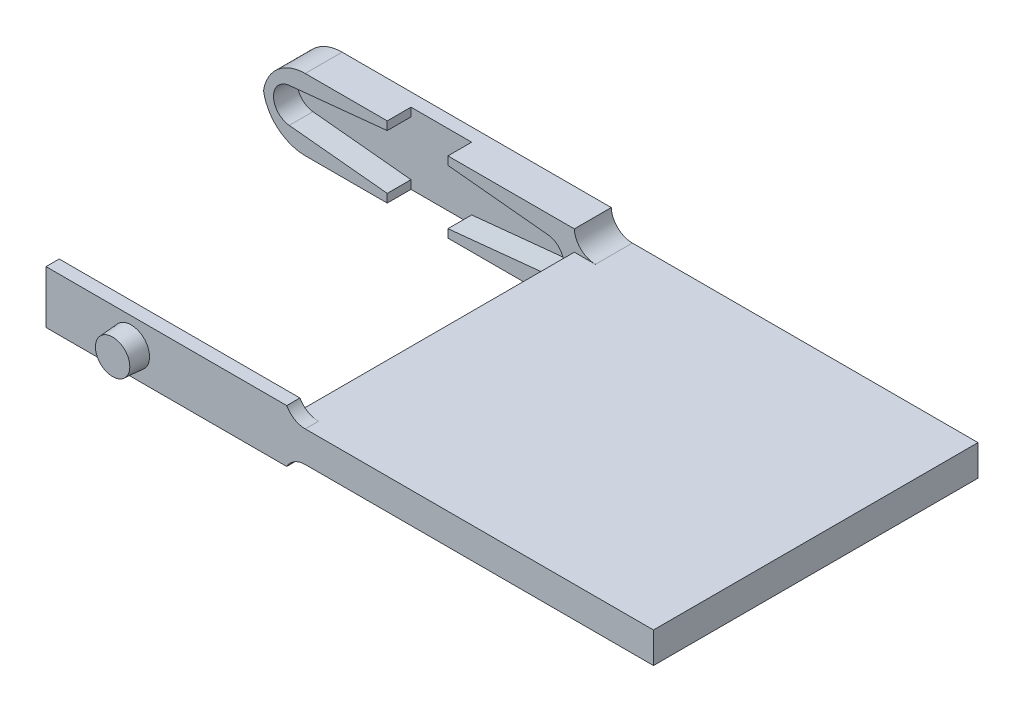
ISO-10303-21;
HEADER;
FILE_DESCRIPTION(('STEP AP214'),'2;1');
FILE_NAME('part.step','',(''),(''),'','','');
FILE_SCHEMA(('AUTOMOTIVE_DESIGN { 1 0 10303 214 1 1 1 1 }'));
ENDSEC;
DATA;
#1=APPLICATION_CONTEXT('core data for automotive mechanical design processes');
#2=APPLICATION_PROTOCOL_DEFINITION('international standard','automotive_design',2000,#1);
#3=PRODUCT_CONTEXT('',#1,'mechanical');
#4=PRODUCT('Part','Part','',(#3));
#5=PRODUCT_RELATED_PRODUCT_CATEGORY('part','',(#4));
#6=PRODUCT_DEFINITION_FORMATION('','',#4);
#7=PRODUCT_DEFINITION_CONTEXT('part definition',#1,'design');
#8=PRODUCT_DEFINITION('design','',#6,#7);
#9=PRODUCT_DEFINITION_SHAPE('','',#8);
#10=(LENGTH_UNIT() NAMED_UNIT(*) SI_UNIT(.MILLI.,.METRE.));
#11=(NAMED_UNIT(*) PLANE_ANGLE_UNIT() SI_UNIT($,.RADIAN.));
#12=(NAMED_UNIT(*) SI_UNIT($,.STERADIAN.) SOLID_ANGLE_UNIT());
#13=UNCERTAINTY_MEASURE_WITH_UNIT(LENGTH_MEASURE(1.E-05),#10,'distance_accuracy_value','');
#14=(GEOMETRIC_REPRESENTATION_CONTEXT(3) GLOBAL_UNCERTAINTY_ASSIGNED_CONTEXT((#13)) GLOBAL_UNIT_ASSIGNED_CONTEXT((#10,
#11,#12)) REPRESENTATION_CONTEXT('',''));
#15=CARTESIAN_POINT('',(0.,0.,0.));
#16=DIRECTION('',(0.,0.,1.));
#17=DIRECTION('',(1.,0.,0.));
#18=AXIS2_PLACEMENT_3D('',#15,#16,#17);
#19=CARTESIAN_POINT('',(0.,0.,3.5));
#20=DIRECTION('',(0.,0.,1.));
#21=DIRECTION('',(1.,0.,0.));
#22=AXIS2_PLACEMENT_3D('',#19,#20,#21);
#23=PLANE('',#22);
#24=DIRECTION('',(0.,-1.,0.));
#25=VECTOR('',#24,1.);
#26=CARTESIAN_POINT('',(-2.97710746417327,0.,3.5));
#27=LINE('',#26,#25);
#28=CARTESIAN_POINT('',(-2.97710746417327,0.799354218210042,3.5));
#29=VERTEX_POINT('',#28);
#30=CARTESIAN_POINT('',(-2.97710746417327,0.,3.5));
#31=VERTEX_POINT('',#30);
#32=EDGE_CURVE('E307',#29,#31,#27,.T.);
#33=ORIENTED_EDGE('',*,*,#32,.F.);
#34=DIRECTION('',(0.994982658758142,-0.10004753255617,0.));
#35=VECTOR('',#34,1.);
#36=CARTESIAN_POINT('',(0.0497727799724651,0.494995245614711,3.5));
#37=LINE('',#36,#35);
#38=CARTESIAN_POINT('',(-12.2650784287177,1.73327861304907,3.5));
#39=VERTEX_POINT('',#38);
#40=EDGE_CURVE('E517',#39,#29,#37,.T.);
#41=ORIENTED_EDGE('',*,*,#40,.F.);
#42=CARTESIAN_POINT('',(-12.1,3.375,3.5));
#43=DIRECTION('',(0.,0.,1.));
#44=DIRECTION('',(1.,0.,0.));
#45=AXIS2_PLACEMENT_3D('',#42,#43,#44);
#46=CIRCLE('',#45,1.65);
#47=CARTESIAN_POINT('',(-12.2650784287177,5.01672138695093,3.5));
#48=VERTEX_POINT('',#47);
#49=EDGE_CURVE('E519',#48,#39,#46,.T.);
#50=ORIENTED_EDGE('',*,*,#49,.F.);
#51=DIRECTION('',(0.994982658758143,0.100047532556171,0.));
#52=VECTOR('',#51,1.);
#53=CARTESIAN_POINT('',(-0.622159749655816,6.18744057018389,3.5));
#54=LINE('',#53,#52);
#55=CARTESIAN_POINT('',(-2.97710746417327,5.95064578178996,3.5));
#56=VERTEX_POINT('',#55);
#57=EDGE_CURVE('E522',#48,#56,#54,.T.);
#58=ORIENTED_EDGE('',*,*,#57,.T.);
#59=DIRECTION('',(0.,-1.,0.));
#60=VECTOR('',#59,1.);
#61=CARTESIAN_POINT('',(-2.97710746417327,6.75000000000001,3.5));
#62=LINE('',#61,#60);
#63=CARTESIAN_POINT('',(-2.97710746417327,6.75000000000001,3.5));
#64=VERTEX_POINT('',#63);
#65=EDGE_CURVE('E581',#64,#56,#62,.T.);
#66=ORIENTED_EDGE('',*,*,#65,.F.);
#67=DIRECTION('',(1.,0.,0.));
#68=VECTOR('',#67,1.);
#69=CARTESIAN_POINT('',(0.,6.75,3.5));
#70=LINE('',#69,#68);
#71=CARTESIAN_POINT('',(-10.75,6.75,3.5));
#72=VERTEX_POINT('',#71);
#73=EDGE_CURVE('E337',#72,#64,#70,.T.);
#74=ORIENTED_EDGE('',*,*,#73,.F.);
#75=CARTESIAN_POINT('',(-10.75,2.75,3.5));
#76=DIRECTION('',(0.,0.,1.));
#77=DIRECTION('',(1.,0.,0.));
#78=AXIS2_PLACEMENT_3D('',#75,#76,#77);
#79=CIRCLE('',#78,4.);
#80=CARTESIAN_POINT('',(-14.7008701573198,3.37499999999999,3.5));
#81=VERTEX_POINT('',#80);
#82=EDGE_CURVE('E125',#72,#81,#79,.T.);
#83=ORIENTED_EDGE('',*,*,#82,.T.);
#84=CARTESIAN_POINT('',(-10.75,4.,3.5));
#85=DIRECTION('',(0.,0.,1.));
#86=DIRECTION('',(1.,0.,0.));
#87=AXIS2_PLACEMENT_3D('',#84,#85,#86);
#88=CIRCLE('',#87,4.);
#89=CARTESIAN_POINT('',(-10.75,0.,3.5));
#90=VERTEX_POINT('',#89);
#91=EDGE_CURVE('E330',#81,#90,#88,.T.);
#92=ORIENTED_EDGE('',*,*,#91,.T.);
#93=DIRECTION('',(1.,0.,0.));
#94=VECTOR('',#93,1.);
#95=CARTESIAN_POINT('',(0.,0.,3.5));
#96=LINE('',#95,#94);
#97=EDGE_CURVE('E324',#90,#31,#96,.T.);
#98=ORIENTED_EDGE('',*,*,#97,.T.);
#99=EDGE_LOOP('',(#33,#41,#50,#58,#66,#74,#83,#92,#98));
#100=FACE_BOUND('',#99,.T.);
#101=ADVANCED_FACE('F116',(#100),#23,.T.);
#102=CARTESIAN_POINT('',(-30.2744558027096,76.9070937366937,30.75));
#103=DIRECTION('',(0.,0.,1.));
#104=DIRECTION('',(-0.245222371799584,-0.969466857798134,0.));
#105=AXIS2_PLACEMENT_3D('',#102,#103,#104);
#106=PLANE('',#105);
#107=DIRECTION('',(1.,0.,0.));
#108=VECTOR('',#107,1.);
#109=CARTESIAN_POINT('',(0.,4.83707186120483,30.75));
#110=LINE('',#109,#108);
#111=CARTESIAN_POINT('',(16.5034017605437,4.83707186120483,30.75));
#112=VERTEX_POINT('',#111);
#113=CARTESIAN_POINT('',(49.5,4.83707186120483,30.75));
#114=VERTEX_POINT('',#113);
#115=EDGE_CURVE('E483',#112,#114,#110,.T.);
#116=ORIENTED_EDGE('',*,*,#115,.F.);
#117=CARTESIAN_POINT('',(16.5034017605437,6.83707186120483,30.75));
#118=DIRECTION('',(0.,0.,1.));
#119=DIRECTION('',(0.,-1.,0.));
#120=AXIS2_PLACEMENT_3D('',#117,#118,#119);
#121=CIRCLE('',#120,2.);
#122=CARTESIAN_POINT('',(14.75,5.875,30.75));
#123=VERTEX_POINT('',#122);
#124=EDGE_CURVE('E410',#112,#123,#121,.F.);
#125=ORIENTED_EDGE('',*,*,#124,.T.);
#126=DIRECTION('',(-1.,0.,0.));
#127=VECTOR('',#126,1.);
#128=CARTESIAN_POINT('',(13.5,5.875,30.75));
#129=LINE('',#128,#127);
#130=CARTESIAN_POINT('',(-8.06135668366892,5.875,30.75));
#131=VERTEX_POINT('',#130);
#132=EDGE_CURVE('E453',#123,#131,#129,.T.);
#133=ORIENTED_EDGE('',*,*,#132,.T.);
#134=DIRECTION('',(0.,-1.,0.));
#135=VECTOR('',#134,1.);
#136=CARTESIAN_POINT('',(-8.06135668366892,5.875,30.75));
#137=LINE('',#136,#135);
#138=CARTESIAN_POINT('',(-8.06135668366892,0.874999999999998,30.75));
#139=VERTEX_POINT('',#138);
#140=EDGE_CURVE('E464',#131,#139,#137,.T.);
#141=ORIENTED_EDGE('',*,*,#140,.T.);
#142=DIRECTION('',(-1.,0.,0.));
#143=VECTOR('',#142,1.);
#144=CARTESIAN_POINT('',(14.75,0.874999999999998,30.75));
#145=LINE('',#144,#143);
#146=CARTESIAN_POINT('',(14.75,0.874999999999998,30.75));
#147=VERTEX_POINT('',#146);
#148=EDGE_CURVE('E448',#147,#139,#145,.T.);
#149=ORIENTED_EDGE('',*,*,#148,.F.);
#150=CARTESIAN_POINT('',(16.5034017605437,-0.0870718612048299,30.75));
#151=DIRECTION('',(0.,0.,1.));
#152=DIRECTION('',(0.,-1.,0.));
#153=AXIS2_PLACEMENT_3D('',#150,#151,#152);
#154=CIRCLE('',#153,2.);
#155=CARTESIAN_POINT('',(16.5034017605437,1.91292813879517,30.75));
#156=VERTEX_POINT('',#155);
#157=EDGE_CURVE('E406',#147,#156,#154,.F.);
#158=ORIENTED_EDGE('',*,*,#157,.T.);
#159=DIRECTION('',(1.,0.,0.));
#160=VECTOR('',#159,1.);
#161=CARTESIAN_POINT('',(0.,1.91292813879517,30.75));
#162=LINE('',#161,#160);
#163=CARTESIAN_POINT('',(49.5,1.91292813879517,30.75));
#164=VERTEX_POINT('',#163);
#165=EDGE_CURVE('E384',#156,#164,#162,.T.);
#166=ORIENTED_EDGE('',*,*,#165,.T.);
#167=DIRECTION('',(0.,-1.,0.));
#168=VECTOR('',#167,1.);
#169=CARTESIAN_POINT('',(49.5,0.,30.75));
#170=LINE('',#169,#168);
#171=EDGE_CURVE('E479',#114,#164,#170,.T.);
#172=ORIENTED_EDGE('',*,*,#171,.F.);
#173=EDGE_LOOP('',(#116,#125,#133,#141,#149,#158,#166,#172));
#174=FACE_BOUND('',#173,.T.);
#175=CARTESIAN_POINT('',(0.,3.37499999999999,30.75));
#176=DIRECTION('',(0.,0.,1.));
#177=DIRECTION('',(1.,0.,0.));
#178=AXIS2_PLACEMENT_3D('',#175,#176,#177);
#179=CIRCLE('',#178,1.75);
#180=CARTESIAN_POINT('',(1.75,3.37499999999999,30.75));
#181=VERTEX_POINT('',#180);
#182=EDGE_CURVE('E431',#181,#181,#179,.T.);
#183=ORIENTED_EDGE('',*,*,#182,.F.);
#184=EDGE_LOOP('',(#183));
#185=FACE_BOUND('',#184,.T.);
#186=ADVANCED_FACE('F618',(#174,#185),#106,.T.);
#187=CARTESIAN_POINT('',(0.,6.75,3.5));
#188=DIRECTION('',(0.,1.,0.));
#189=DIRECTION('',(0.,0.,1.));
#190=AXIS2_PLACEMENT_3D('',#187,#188,#189);
#191=PLANE('',#190);
#192=DIRECTION('',(0.,0.,1.));
#193=VECTOR('',#192,1.);
#194=CARTESIAN_POINT('',(-2.97710746417327,6.75000000000001,-4.60902082263029));
#195=LINE('',#194,#193);
#196=CARTESIAN_POINT('',(-2.97710746417327,6.75000000000001,1.24999999999871));
#197=VERTEX_POINT('',#196);
#198=EDGE_CURVE('E442',#197,#64,#195,.T.);
#199=ORIENTED_EDGE('',*,*,#198,.F.);
#200=DIRECTION('',(-1.,0.,0.));
#201=VECTOR('',#200,1.);
#202=CARTESIAN_POINT('',(-2.97710746417327,6.75000000000001,1.24999999999871));
#203=LINE('',#202,#201);
#204=CARTESIAN_POINT('',(2.77289253582675,6.75000000000001,1.24999999999871));
#205=VERTEX_POINT('',#204);
#206=EDGE_CURVE('E589',#205,#197,#203,.T.);
#207=ORIENTED_EDGE('',*,*,#206,.F.);
#208=DIRECTION('',(0.,0.,1.));
#209=VECTOR('',#208,1.);
#210=CARTESIAN_POINT('',(2.77289253582675,6.75000000000001,-4.60902082263029));
#211=LINE('',#210,#209);
#212=CARTESIAN_POINT('',(2.77289253582675,6.75000000000001,3.5));
#213=VERTEX_POINT('',#212);
#214=EDGE_CURVE('E592',#205,#213,#211,.T.);
#215=ORIENTED_EDGE('',*,*,#214,.T.);
#216=CARTESIAN_POINT('',(14.75,6.75,3.5));
#217=VERTEX_POINT('',#216);
#218=EDGE_CURVE('E525',#213,#217,#70,.T.);
#219=ORIENTED_EDGE('',*,*,#218,.T.);
#220=DIRECTION('',(0.,0.,-1.));
#221=VECTOR('',#220,1.);
#222=CARTESIAN_POINT('',(14.75,6.75,3.5));
#223=LINE('',#222,#221);
#224=CARTESIAN_POINT('',(14.75,6.75,0.));
#225=VERTEX_POINT('',#224);
#226=EDGE_CURVE('E350',#217,#225,#223,.T.);
#227=ORIENTED_EDGE('',*,*,#226,.T.);
#228=DIRECTION('',(1.,0.,0.));
#229=VECTOR('',#228,1.);
#230=CARTESIAN_POINT('',(0.,6.75,0.));
#231=LINE('',#230,#229);
#232=CARTESIAN_POINT('',(-10.75,6.75,0.));
#233=VERTEX_POINT('',#232);
#234=EDGE_CURVE('E341',#233,#225,#231,.T.);
#235=ORIENTED_EDGE('',*,*,#234,.F.);
#236=DIRECTION('',(0.,0.,-1.));
#237=VECTOR('',#236,1.);
#238=CARTESIAN_POINT('',(-10.75,6.75,3.5));
#239=LINE('',#238,#237);
#240=EDGE_CURVE('E416',#233,#72,#239,.F.);
#241=ORIENTED_EDGE('',*,*,#240,.T.);
#242=ORIENTED_EDGE('',*,*,#73,.T.);
#243=EDGE_LOOP('',(#199,#207,#215,#219,#227,#235,#241,#242));
#244=FACE_BOUND('',#243,.T.);
#245=ADVANCED_FACE('F533',(#244),#191,.T.);
#246=CARTESIAN_POINT('',(0.622159749655816,6.18744057018389,3.5));
#247=DIRECTION('',(-0.100047532556171,-0.994982658758142,0.));
#248=DIRECTION('',(0.994982658758142,-0.100047532556171,0.));
#249=AXIS2_PLACEMENT_3D('',#246,#247,#248);
#250=PLANE('',#249);
#251=DIRECTION('',(0.,0.,1.));
#252=VECTOR('',#251,1.);
#253=CARTESIAN_POINT('',(2.77289253582675,5.97118000870574,3.5));
#254=LINE('',#253,#252);
#255=CARTESIAN_POINT('',(2.77289253582675,5.97118000870574,1.24999999999871));
#256=VERTEX_POINT('',#255);
#257=CARTESIAN_POINT('',(2.77289253582675,5.97118000870574,3.5));
#258=VERTEX_POINT('',#257);
#259=EDGE_CURVE('E140',#256,#258,#254,.T.);
#260=ORIENTED_EDGE('',*,*,#259,.F.);
#261=DIRECTION('',(-0.994982658758143,0.100047532556171,0.));
#262=VECTOR('',#261,1.);
#263=CARTESIAN_POINT('',(0.622159749655816,6.18744057018389,1.25));
#264=LINE('',#263,#262);
#265=CARTESIAN_POINT('',(12.2650784287177,5.01672138695093,1.25));
#266=VERTEX_POINT('',#265);
#267=EDGE_CURVE('E498',#266,#256,#264,.T.);
#268=ORIENTED_EDGE('',*,*,#267,.F.);
#269=DIRECTION('',(0.,0.,-1.));
#270=VECTOR('',#269,1.);
#271=CARTESIAN_POINT('',(12.2650784287177,5.01672138695093,3.5));
#272=LINE('',#271,#270);
#273=CARTESIAN_POINT('',(12.2650784287177,5.01672138695093,3.5));
#274=VERTEX_POINT('',#273);
#275=EDGE_CURVE('E351',#274,#266,#272,.T.);
#276=ORIENTED_EDGE('',*,*,#275,.F.);
#277=DIRECTION('',(-0.994982658758143,0.100047532556171,0.));
#278=VECTOR('',#277,1.);
#279=CARTESIAN_POINT('',(0.622159749655816,6.18744057018389,3.5));
#280=LINE('',#279,#278);
#281=EDGE_CURVE('E346',#274,#258,#280,.T.);
#282=ORIENTED_EDGE('',*,*,#281,.T.);
#283=EDGE_LOOP('',(#260,#268,#276,#282));
#284=FACE_BOUND('',#283,.T.);
#285=ADVANCED_FACE('F639',(#284),#250,.T.);
#286=CARTESIAN_POINT('',(12.1,3.375,3.5));
#287=DIRECTION('',(0.,0.,-1.));
#288=DIRECTION('',(-1.,0.,0.));
#289=AXIS2_PLACEMENT_3D('',#286,#287,#288);
#290=CYLINDRICAL_SURFACE('',#289,1.64999999999999);
#291=ORIENTED_EDGE('',*,*,#275,.T.);
#292=CARTESIAN_POINT('',(12.1,3.375,1.25));
#293=DIRECTION('',(0.,0.,1.));
#294=DIRECTION('',(1.,0.,0.));
#295=AXIS2_PLACEMENT_3D('',#292,#293,#294);
#296=CIRCLE('',#295,1.64999999999999);
#297=CARTESIAN_POINT('',(12.2650784287177,1.73327861304907,1.25));
#298=VERTEX_POINT('',#297);
#299=EDGE_CURVE('E495',#266,#298,#296,.F.);
#300=ORIENTED_EDGE('',*,*,#299,.T.);
#301=DIRECTION('',(0.,0.,-1.));
#302=VECTOR('',#301,1.);
#303=CARTESIAN_POINT('',(12.2650784287177,1.73327861304907,3.5));
#304=LINE('',#303,#302);
#305=CARTESIAN_POINT('',(12.2650784287177,1.73327861304907,3.5));
#306=VERTEX_POINT('',#305);
#307=EDGE_CURVE('E357',#306,#298,#304,.T.);
#308=ORIENTED_EDGE('',*,*,#307,.F.);
#309=CARTESIAN_POINT('',(12.1,3.375,3.5));
#310=DIRECTION('',(0.,0.,1.));
#311=DIRECTION('',(1.,0.,0.));
#312=AXIS2_PLACEMENT_3D('',#309,#310,#311);
#313=CIRCLE('',#312,1.64999999999999);
#314=EDGE_CURVE('E512',#274,#306,#313,.F.);
#315=ORIENTED_EDGE('',*,*,#314,.F.);
#316=EDGE_LOOP('',(#291,#300,#308,#315));
#317=FACE_BOUND('',#316,.T.);
#318=ADVANCED_FACE('F614',(#317),#290,.F.);
#319=CARTESIAN_POINT('',(-0.0497727799724653,0.49499524561471,3.5));
#320=DIRECTION('',(0.100047532556171,-0.994982658758142,0.));
#321=DIRECTION('',(0.994982658758143,0.100047532556171,0.));
#322=AXIS2_PLACEMENT_3D('',#319,#320,#321);
#323=PLANE('',#322);
#324=DIRECTION('',(-0.994982658758142,-0.100047532556171,0.));
#325=VECTOR('',#324,1.);
#326=CARTESIAN_POINT('',(-0.0497727799724653,0.49499524561471,1.25));
#327=LINE('',#326,#325);
#328=CARTESIAN_POINT('',(2.77289253582675,0.778819991294264,1.24999999999871));
#329=VERTEX_POINT('',#328);
#330=EDGE_CURVE('E344',#298,#329,#327,.T.);
#331=ORIENTED_EDGE('',*,*,#330,.T.);
#332=DIRECTION('',(0.,0.,1.));
#333=VECTOR('',#332,1.);
#334=CARTESIAN_POINT('',(2.77289253582675,0.778819991294264,3.5));
#335=LINE('',#334,#333);
#336=CARTESIAN_POINT('',(2.77289253582675,0.778819991294264,3.5));
#337=VERTEX_POINT('',#336);
#338=EDGE_CURVE('E575',#329,#337,#335,.T.);
#339=ORIENTED_EDGE('',*,*,#338,.T.);
#340=DIRECTION('',(-0.994982658758142,-0.100047532556171,0.));
#341=VECTOR('',#340,1.);
#342=CARTESIAN_POINT('',(-0.0497727799724653,0.49499524561471,3.5));
#343=LINE('',#342,#341);
#344=EDGE_CURVE('E514',#306,#337,#343,.T.);
#345=ORIENTED_EDGE('',*,*,#344,.F.);
#346=ORIENTED_EDGE('',*,*,#307,.T.);
#347=EDGE_LOOP('',(#331,#339,#345,#346));
#348=FACE_BOUND('',#347,.T.);
#349=ADVANCED_FACE('F607',(#348),#323,.F.);
#350=CARTESIAN_POINT('',(0.0497727799724651,0.494995245614711,3.5));
#351=DIRECTION('',(0.10004753255617,0.994982658758143,0.));
#352=DIRECTION('',(-0.994982658758143,0.10004753255617,0.));
#353=AXIS2_PLACEMENT_3D('',#350,#351,#352);
#354=PLANE('',#353);
#355=DIRECTION('',(0.,0.,1.));
#356=VECTOR('',#355,1.);
#357=CARTESIAN_POINT('',(-2.97710746417327,0.799354218210042,3.5));
#358=LINE('',#357,#356);
#359=CARTESIAN_POINT('',(-2.97710746417327,0.799354218210042,1.24999999999871));
#360=VERTEX_POINT('',#359);
#361=EDGE_CURVE('E313',#360,#29,#358,.T.);
#362=ORIENTED_EDGE('',*,*,#361,.F.);
#363=DIRECTION('',(0.994982658758142,-0.10004753255617,0.));
#364=VECTOR('',#363,1.);
#365=CARTESIAN_POINT('',(0.0497727799724651,0.494995245614711,1.25));
#366=LINE('',#365,#364);
#367=CARTESIAN_POINT('',(-12.2650784287177,1.73327861304907,1.25));
#368=VERTEX_POINT('',#367);
#369=EDGE_CURVE('E505',#368,#360,#366,.T.);
#370=ORIENTED_EDGE('',*,*,#369,.F.);
#371=DIRECTION('',(0.,0.,-1.));
#372=VECTOR('',#371,1.);
#373=CARTESIAN_POINT('',(-12.2650784287177,1.73327861304907,3.5));
#374=LINE('',#373,#372);
#375=EDGE_CURVE('E335',#39,#368,#374,.T.);
#376=ORIENTED_EDGE('',*,*,#375,.F.);
#377=ORIENTED_EDGE('',*,*,#40,.T.);
#378=EDGE_LOOP('',(#362,#370,#376,#377));
#379=FACE_BOUND('',#378,.T.);
#380=ADVANCED_FACE('F605',(#379),#354,.T.);
#381=CARTESIAN_POINT('',(-12.1,3.375,3.5));
#382=DIRECTION('',(0.,0.,-1.));
#383=DIRECTION('',(-1.,0.,0.));
#384=AXIS2_PLACEMENT_3D('',#381,#382,#383);
#385=CYLINDRICAL_SURFACE('',#384,1.65);
#386=CARTESIAN_POINT('',(-12.1,3.375,1.25));
#387=DIRECTION('',(0.,0.,1.));
#388=DIRECTION('',(1.,0.,0.));
#389=AXIS2_PLACEMENT_3D('',#386,#387,#388);
#390=CIRCLE('',#389,1.65);
#391=CARTESIAN_POINT('',(-12.2650784287177,5.01672138695093,1.25));
#392=VERTEX_POINT('',#391);
#393=EDGE_CURVE('E503',#392,#368,#390,.T.);
#394=ORIENTED_EDGE('',*,*,#393,.F.);
#395=DIRECTION('',(0.,0.,-1.));
#396=VECTOR('',#395,1.);
#397=CARTESIAN_POINT('',(-12.2650784287177,5.01672138695093,3.5));
#398=LINE('',#397,#396);
#399=EDGE_CURVE('E331',#48,#392,#398,.T.);
#400=ORIENTED_EDGE('',*,*,#399,.F.);
#401=ORIENTED_EDGE('',*,*,#49,.T.);
#402=ORIENTED_EDGE('',*,*,#375,.T.);
#403=EDGE_LOOP('',(#394,#400,#401,#402));
#404=FACE_BOUND('',#403,.T.);
#405=ADVANCED_FACE('F600',(#404),#385,.F.);
#406=CARTESIAN_POINT('',(-0.622159749655816,6.18744057018389,3.5));
#407=DIRECTION('',(-0.100047532556171,0.994982658758142,0.));
#408=DIRECTION('',(-0.994982658758142,-0.100047532556171,0.));
#409=AXIS2_PLACEMENT_3D('',#406,#407,#408);
#410=PLANE('',#409);
#411=DIRECTION('',(0.994982658758143,0.100047532556171,0.));
#412=VECTOR('',#411,1.);
#413=CARTESIAN_POINT('',(-0.622159749655816,6.18744057018389,1.25));
#414=LINE('',#413,#412);
#415=CARTESIAN_POINT('',(-2.97710746417327,5.95064578178996,1.24999999999871));
#416=VERTEX_POINT('',#415);
#417=EDGE_CURVE('E501',#392,#416,#414,.T.);
#418=ORIENTED_EDGE('',*,*,#417,.T.);
#419=DIRECTION('',(0.,0.,1.));
#420=VECTOR('',#419,1.);
#421=CARTESIAN_POINT('',(-2.97710746417327,5.95064578178996,3.5));
#422=LINE('',#421,#420);
#423=EDGE_CURVE('E432',#416,#56,#422,.T.);
#424=ORIENTED_EDGE('',*,*,#423,.T.);
#425=ORIENTED_EDGE('',*,*,#57,.F.);
#426=ORIENTED_EDGE('',*,*,#399,.T.);
#427=EDGE_LOOP('',(#418,#424,#425,#426));
#428=FACE_BOUND('',#427,.T.);
#429=ADVANCED_FACE('F597',(#428),#410,.F.);
#430=CARTESIAN_POINT('',(0.,0.,3.5));
#431=DIRECTION('',(0.,1.,0.));
#432=DIRECTION('',(0.,0.,1.));
#433=AXIS2_PLACEMENT_3D('',#430,#431,#432);
#434=PLANE('',#433);
#435=DIRECTION('',(1.,0.,0.));
#436=VECTOR('',#435,1.);
#437=CARTESIAN_POINT('',(-2.97710746417327,0.,1.24999999999871));
#438=LINE('',#437,#436);
#439=CARTESIAN_POINT('',(-2.97710746417327,0.,1.24999999999871));
#440=VERTEX_POINT('',#439);
#441=CARTESIAN_POINT('',(2.77289253582675,0.,1.24999999999872));
#442=VERTEX_POINT('',#441);
#443=EDGE_CURVE('E327',#440,#442,#438,.T.);
#444=ORIENTED_EDGE('',*,*,#443,.F.);
#445=DIRECTION('',(0.,0.,1.));
#446=VECTOR('',#445,1.);
#447=CARTESIAN_POINT('',(-2.97710746417327,0.,-4.60902082263029));
#448=LINE('',#447,#446);
#449=EDGE_CURVE('E310',#440,#31,#448,.T.);
#450=ORIENTED_EDGE('',*,*,#449,.T.);
#451=ORIENTED_EDGE('',*,*,#97,.F.);
#452=DIRECTION('',(0.,0.,-1.));
#453=VECTOR('',#452,1.);
#454=CARTESIAN_POINT('',(-10.75,0.,0.));
#455=LINE('',#454,#453);
#456=CARTESIAN_POINT('',(-10.75,0.,0.));
#457=VERTEX_POINT('',#456);
#458=EDGE_CURVE('E13',#90,#457,#455,.T.);
#459=ORIENTED_EDGE('',*,*,#458,.T.);
#460=DIRECTION('',(1.,0.,0.));
#461=VECTOR('',#460,1.);
#462=CARTESIAN_POINT('',(0.,0.,0.));
#463=LINE('',#462,#461);
#464=CARTESIAN_POINT('',(14.75,0.,0.));
#465=VERTEX_POINT('',#464);
#466=EDGE_CURVE('E343',#457,#465,#463,.T.);
#467=ORIENTED_EDGE('',*,*,#466,.T.);
#468=DIRECTION('',(0.,0.,-1.));
#469=VECTOR('',#468,1.);
#470=CARTESIAN_POINT('',(14.75,0.,3.5));
#471=LINE('',#470,#469);
#472=CARTESIAN_POINT('',(14.75,0.,3.5));
#473=VERTEX_POINT('',#472);
#474=EDGE_CURVE('E347',#473,#465,#471,.T.);
#475=ORIENTED_EDGE('',*,*,#474,.F.);
#476=CARTESIAN_POINT('',(2.77289253582675,0.,3.5));
#477=VERTEX_POINT('',#476);
#478=EDGE_CURVE('E332',#477,#473,#96,.T.);
#479=ORIENTED_EDGE('',*,*,#478,.F.);
#480=DIRECTION('',(0.,0.,1.));
#481=VECTOR('',#480,1.);
#482=CARTESIAN_POINT('',(2.77289253582675,0.,-4.60902082263029));
#483=LINE('',#482,#481);
#484=EDGE_CURVE('E132',#442,#477,#483,.T.);
#485=ORIENTED_EDGE('',*,*,#484,.F.);
#486=EDGE_LOOP('',(#444,#450,#451,#459,#467,#475,#479,#485));
#487=FACE_BOUND('',#486,.T.);
#488=ADVANCED_FACE('F323',(#487),#434,.F.);
#489=DIRECTION('',(0.,1.,0.));
#490=VECTOR('',#489,1.);
#491=CARTESIAN_POINT('',(2.77289253582675,0.,3.5));
#492=LINE('',#491,#490);
#493=EDGE_CURVE('E319',#477,#337,#492,.T.);
#494=ORIENTED_EDGE('',*,*,#493,.F.);
#495=ORIENTED_EDGE('',*,*,#478,.T.);
#496=CARTESIAN_POINT('',(16.7481037237807,-0.0870718612048299,3.5));
#497=DIRECTION('',(0.,0.,1.));
#498=DIRECTION('',(1.,0.,0.));
#499=AXIS2_PLACEMENT_3D('',#496,#497,#498);
#500=CIRCLE('',#499,2.);
#501=CARTESIAN_POINT('',(16.7481037237807,1.91292813879517,3.5));
#502=VERTEX_POINT('',#501);
#503=EDGE_CURVE('E397',#473,#502,#500,.F.);
#504=ORIENTED_EDGE('',*,*,#503,.T.);
#505=DIRECTION('',(1.,0.,0.));
#506=VECTOR('',#505,1.);
#507=CARTESIAN_POINT('',(0.,1.91292813879517,3.5));
#508=LINE('',#507,#506);
#509=CARTESIAN_POINT('',(14.75,1.91292813879517,3.5));
#510=VERTEX_POINT('',#509);
#511=EDGE_CURVE('E374',#510,#502,#508,.T.);
#512=ORIENTED_EDGE('',*,*,#511,.F.);
#513=DIRECTION('',(0.,-1.,0.));
#514=VECTOR('',#513,1.);
#515=CARTESIAN_POINT('',(14.75,0.,3.5));
#516=LINE('',#515,#514);
#517=CARTESIAN_POINT('',(14.75,4.83707186120483,3.5));
#518=VERTEX_POINT('',#517);
#519=EDGE_CURVE('E523',#518,#510,#516,.T.);
#520=ORIENTED_EDGE('',*,*,#519,.F.);
#521=DIRECTION('',(-1.,0.,0.));
#522=VECTOR('',#521,1.);
#523=CARTESIAN_POINT('',(0.,4.83707186120483,3.5));
#524=LINE('',#523,#522);
#525=CARTESIAN_POINT('',(16.7481037237807,4.83707186120483,3.5));
#526=VERTEX_POINT('',#525);
#527=EDGE_CURVE('E389',#526,#518,#524,.T.);
#528=ORIENTED_EDGE('',*,*,#527,.F.);
#529=CARTESIAN_POINT('',(16.7481037237807,6.83707186120483,3.5));
#530=DIRECTION('',(0.,0.,1.));
#531=DIRECTION('',(1.,0.,0.));
#532=AXIS2_PLACEMENT_3D('',#529,#530,#531);
#533=CIRCLE('',#532,2.);
#534=EDGE_CURVE('E401',#526,#217,#533,.F.);
#535=ORIENTED_EDGE('',*,*,#534,.T.);
#536=ORIENTED_EDGE('',*,*,#218,.F.);
#537=DIRECTION('',(0.,1.,0.));
#538=VECTOR('',#537,1.);
#539=CARTESIAN_POINT('',(2.77289253582675,6.75000000000001,3.5));
#540=LINE('',#539,#538);
#541=EDGE_CURVE('E582',#258,#213,#540,.T.);
#542=ORIENTED_EDGE('',*,*,#541,.F.);
#543=ORIENTED_EDGE('',*,*,#281,.F.);
#544=ORIENTED_EDGE('',*,*,#314,.T.);
#545=ORIENTED_EDGE('',*,*,#344,.T.);
#546=EDGE_LOOP('',(#494,#495,#504,#512,#520,#528,#535,#536,#542,#543,#544,#545));
#547=FACE_BOUND('',#546,.T.);
#548=ADVANCED_FACE('F567',(#547),#23,.T.);
#549=CARTESIAN_POINT('',(0.,0.,0.));
#550=DIRECTION('',(0.,0.,1.));
#551=DIRECTION('',(1.,0.,0.));
#552=AXIS2_PLACEMENT_3D('',#549,#550,#551);
#553=PLANE('',#552);
#554=CARTESIAN_POINT('',(-10.75,4.,0.));
#555=DIRECTION('',(0.,0.,1.));
#556=DIRECTION('',(1.,0.,0.));
#557=AXIS2_PLACEMENT_3D('',#554,#555,#556);
#558=CIRCLE('',#557,4.);
#559=CARTESIAN_POINT('',(-14.7008701573198,3.37499999999999,0.));
#560=VERTEX_POINT('',#559);
#561=EDGE_CURVE('E412',#457,#560,#558,.F.);
#562=ORIENTED_EDGE('',*,*,#561,.T.);
#563=CARTESIAN_POINT('',(-10.75,2.75,0.));
#564=DIRECTION('',(0.,0.,1.));
#565=DIRECTION('',(1.,0.,0.));
#566=AXIS2_PLACEMENT_3D('',#563,#564,#565);
#567=CIRCLE('',#566,4.);
#568=EDGE_CURVE('E414',#560,#233,#567,.F.);
#569=ORIENTED_EDGE('',*,*,#568,.T.);
#570=ORIENTED_EDGE('',*,*,#234,.T.);
#571=CARTESIAN_POINT('',(16.7481037237807,6.83707186120483,0.));
#572=DIRECTION('',(0.,0.,1.));
#573=DIRECTION('',(1.,0.,0.));
#574=AXIS2_PLACEMENT_3D('',#571,#572,#573);
#575=CIRCLE('',#574,2.);
#576=CARTESIAN_POINT('',(16.7481037237807,4.83707186120483,0.));
#577=VERTEX_POINT('',#576);
#578=EDGE_CURVE('E399',#225,#577,#575,.T.);
#579=ORIENTED_EDGE('',*,*,#578,.T.);
#580=DIRECTION('',(1.,0.,0.));
#581=VECTOR('',#580,1.);
#582=CARTESIAN_POINT('',(0.,4.83707186120483,0.));
#583=LINE('',#582,#581);
#584=CARTESIAN_POINT('',(49.5,4.83707186120483,0.));
#585=VERTEX_POINT('',#584);
#586=EDGE_CURVE('E381',#577,#585,#583,.T.);
#587=ORIENTED_EDGE('',*,*,#586,.T.);
#588=DIRECTION('',(0.,-1.,0.));
#589=VECTOR('',#588,1.);
#590=CARTESIAN_POINT('',(49.5,0.,0.));
#591=LINE('',#590,#589);
#592=CARTESIAN_POINT('',(49.5,1.91292813879517,0.));
#593=VERTEX_POINT('',#592);
#594=EDGE_CURVE('E383',#585,#593,#591,.T.);
#595=ORIENTED_EDGE('',*,*,#594,.T.);
#596=DIRECTION('',(1.,0.,0.));
#597=VECTOR('',#596,1.);
#598=CARTESIAN_POINT('',(0.,1.91292813879517,0.));
#599=LINE('',#598,#597);
#600=CARTESIAN_POINT('',(16.7481037237807,1.91292813879517,0.));
#601=VERTEX_POINT('',#600);
#602=EDGE_CURVE('E366',#601,#593,#599,.T.);
#603=ORIENTED_EDGE('',*,*,#602,.F.);
#604=CARTESIAN_POINT('',(16.7481037237807,-0.0870718612048299,0.));
#605=DIRECTION('',(0.,0.,1.));
#606=DIRECTION('',(1.,0.,0.));
#607=AXIS2_PLACEMENT_3D('',#604,#605,#606);
#608=CIRCLE('',#607,2.);
#609=EDGE_CURVE('E394',#601,#465,#608,.T.);
#610=ORIENTED_EDGE('',*,*,#609,.T.);
#611=ORIENTED_EDGE('',*,*,#466,.F.);
#612=EDGE_LOOP('',(#562,#569,#570,#579,#587,#595,#603,#610,#611));
#613=FACE_BOUND('',#612,.T.);
#614=ADVANCED_FACE('F539',(#613),#553,.F.);
#615=CARTESIAN_POINT('',(0.,0.,1.25));
#616=DIRECTION('',(0.,0.,1.));
#617=DIRECTION('',(1.,0.,0.));
#618=AXIS2_PLACEMENT_3D('',#615,#616,#617);
#619=PLANE('',#618);
#620=ORIENTED_EDGE('',*,*,#369,.T.);
#621=DIRECTION('',(0.,-1.,0.));
#622=VECTOR('',#621,1.);
#623=CARTESIAN_POINT('',(-2.97710746417327,0.,1.24999999999871));
#624=LINE('',#623,#622);
#625=EDGE_CURVE('E318',#360,#440,#624,.T.);
#626=ORIENTED_EDGE('',*,*,#625,.T.);
#627=ORIENTED_EDGE('',*,*,#443,.T.);
#628=DIRECTION('',(0.,1.,0.));
#629=VECTOR('',#628,1.);
#630=CARTESIAN_POINT('',(2.77289253582675,0.,1.24999999999871));
#631=LINE('',#630,#629);
#632=EDGE_CURVE('E572',#442,#329,#631,.T.);
#633=ORIENTED_EDGE('',*,*,#632,.T.);
#634=ORIENTED_EDGE('',*,*,#330,.F.);
#635=ORIENTED_EDGE('',*,*,#299,.F.);
#636=ORIENTED_EDGE('',*,*,#267,.T.);
#637=DIRECTION('',(0.,1.,0.));
#638=VECTOR('',#637,1.);
#639=CARTESIAN_POINT('',(2.77289253582675,6.75000000000001,1.24999999999871));
#640=LINE('',#639,#638);
#641=EDGE_CURVE('E588',#256,#205,#640,.T.);
#642=ORIENTED_EDGE('',*,*,#641,.T.);
#643=ORIENTED_EDGE('',*,*,#206,.T.);
#644=DIRECTION('',(0.,-1.,0.));
#645=VECTOR('',#644,1.);
#646=CARTESIAN_POINT('',(-2.97710746417327,6.75000000000001,1.24999999999871));
#647=LINE('',#646,#645);
#648=EDGE_CURVE('E584',#197,#416,#647,.T.);
#649=ORIENTED_EDGE('',*,*,#648,.T.);
#650=ORIENTED_EDGE('',*,*,#417,.F.);
#651=ORIENTED_EDGE('',*,*,#393,.T.);
#652=EDGE_LOOP('',(#620,#626,#627,#633,#634,#635,#636,#642,#643,#649,#650,#651));
#653=FACE_BOUND('',#652,.T.);
#654=ADVANCED_FACE('F603',(#653),#619,.T.);
#655=CARTESIAN_POINT('',(14.75,0.,67.1228134297953));
#656=DIRECTION('',(1.,0.,0.));
#657=DIRECTION('',(0.,1.,0.));
#658=AXIS2_PLACEMENT_3D('',#655,#656,#657);
#659=PLANE('',#658);
#660=DIRECTION('',(0.,0.,-1.));
#661=VECTOR('',#660,1.);
#662=CARTESIAN_POINT('',(14.75,1.91292813879517,67.1228134297953));
#663=LINE('',#662,#661);
#664=CARTESIAN_POINT('',(14.75,1.91292813879517,29.5));
#665=VERTEX_POINT('',#664);
#666=EDGE_CURVE('E369',#665,#510,#663,.T.);
#667=ORIENTED_EDGE('',*,*,#666,.F.);
#668=DIRECTION('',(0.,-1.,0.));
#669=VECTOR('',#668,1.);
#670=CARTESIAN_POINT('',(14.75,5.875,29.5));
#671=LINE('',#670,#669);
#672=CARTESIAN_POINT('',(14.75,4.83707186120483,29.5));
#673=VERTEX_POINT('',#672);
#674=EDGE_CURVE('E452',#673,#665,#671,.T.);
#675=ORIENTED_EDGE('',*,*,#674,.F.);
#676=DIRECTION('',(0.,0.,-1.));
#677=VECTOR('',#676,1.);
#678=CARTESIAN_POINT('',(14.75,4.83707186120483,67.1228134297953));
#679=LINE('',#678,#677);
#680=EDGE_CURVE('E368',#673,#518,#679,.T.);
#681=ORIENTED_EDGE('',*,*,#680,.T.);
#682=ORIENTED_EDGE('',*,*,#519,.T.);
#683=EDGE_LOOP('',(#667,#675,#681,#682));
#684=FACE_BOUND('',#683,.T.);
#685=ADVANCED_FACE('F756',(#684),#659,.F.);
#686=CARTESIAN_POINT('',(49.5,0.,67.1228134297953));
#687=DIRECTION('',(1.,0.,0.));
#688=DIRECTION('',(0.,0.,-1.));
#689=AXIS2_PLACEMENT_3D('',#686,#687,#688);
#690=PLANE('',#689);
#691=DIRECTION('',(0.,0.,-1.));
#692=VECTOR('',#691,1.);
#693=CARTESIAN_POINT('',(49.5,4.83707186120483,67.1228134297953));
#694=LINE('',#693,#692);
#695=EDGE_CURVE('E485',#114,#585,#694,.T.);
#696=ORIENTED_EDGE('',*,*,#695,.F.);
#697=ORIENTED_EDGE('',*,*,#171,.T.);
#698=DIRECTION('',(0.,0.,-1.));
#699=VECTOR('',#698,1.);
#700=CARTESIAN_POINT('',(49.5,1.91292813879517,67.1228134297953));
#701=LINE('',#700,#699);
#702=EDGE_CURVE('E482',#164,#593,#701,.T.);
#703=ORIENTED_EDGE('',*,*,#702,.T.);
#704=ORIENTED_EDGE('',*,*,#594,.F.);
#705=EDGE_LOOP('',(#696,#697,#703,#704));
#706=FACE_BOUND('',#705,.T.);
#707=ADVANCED_FACE('F552',(#706),#690,.T.);
#708=CARTESIAN_POINT('',(0.,1.91292813879517,67.1228134297953));
#709=DIRECTION('',(0.,1.,0.));
#710=DIRECTION('',(0.,0.,1.));
#711=AXIS2_PLACEMENT_3D('',#708,#709,#710);
#712=PLANE('',#711);
#713=ORIENTED_EDGE('',*,*,#511,.T.);
#714=DIRECTION('',(0.,0.,1.));
#715=VECTOR('',#714,1.);
#716=CARTESIAN_POINT('',(16.7481037237807,1.91292813879517,67.1228134297953));
#717=LINE('',#716,#715);
#718=EDGE_CURVE('E377',#502,#601,#717,.F.);
#719=ORIENTED_EDGE('',*,*,#718,.T.);
#720=ORIENTED_EDGE('',*,*,#602,.T.);
#721=ORIENTED_EDGE('',*,*,#702,.F.);
#722=ORIENTED_EDGE('',*,*,#165,.F.);
#723=DIRECTION('',(0.,0.,-1.));
#724=VECTOR('',#723,1.);
#725=CARTESIAN_POINT('',(16.5034017605437,1.91292813879517,67.1228134297953));
#726=LINE('',#725,#724);
#727=CARTESIAN_POINT('',(16.5034017605437,1.91292813879517,29.5));
#728=VERTEX_POINT('',#727);
#729=EDGE_CURVE('E371',#156,#728,#726,.T.);
#730=ORIENTED_EDGE('',*,*,#729,.T.);
#731=DIRECTION('',(-1.,0.,0.));
#732=VECTOR('',#731,1.);
#733=CARTESIAN_POINT('',(0.,1.91292813879517,29.5));
#734=LINE('',#733,#732);
#735=EDGE_CURVE('E353',#728,#665,#734,.T.);
#736=ORIENTED_EDGE('',*,*,#735,.T.);
#737=ORIENTED_EDGE('',*,*,#666,.T.);
#738=EDGE_LOOP('',(#713,#719,#720,#721,#722,#730,#736,#737));
#739=FACE_BOUND('',#738,.T.);
#740=ADVANCED_FACE('F557',(#739),#712,.F.);
#741=CARTESIAN_POINT('',(0.,4.83707186120483,67.1228134297953));
#742=DIRECTION('',(0.,1.,0.));
#743=DIRECTION('',(0.,0.,1.));
#744=AXIS2_PLACEMENT_3D('',#741,#742,#743);
#745=PLANE('',#744);
#746=ORIENTED_EDGE('',*,*,#586,.F.);
#747=DIRECTION('',(0.,0.,-1.));
#748=VECTOR('',#747,1.);
#749=CARTESIAN_POINT('',(16.7481037237807,4.83707186120483,3.5));
#750=LINE('',#749,#748);
#751=EDGE_CURVE('E391',#577,#526,#750,.F.);
#752=ORIENTED_EDGE('',*,*,#751,.T.);
#753=ORIENTED_EDGE('',*,*,#527,.T.);
#754=ORIENTED_EDGE('',*,*,#680,.F.);
#755=DIRECTION('',(1.,0.,0.));
#756=VECTOR('',#755,1.);
#757=CARTESIAN_POINT('',(0.,4.83707186120483,29.5));
#758=LINE('',#757,#756);
#759=CARTESIAN_POINT('',(16.5034017605437,4.83707186120483,29.5));
#760=VERTEX_POINT('',#759);
#761=EDGE_CURVE('E386',#673,#760,#758,.T.);
#762=ORIENTED_EDGE('',*,*,#761,.T.);
#763=DIRECTION('',(0.,0.,1.));
#764=VECTOR('',#763,1.);
#765=CARTESIAN_POINT('',(16.5034017605437,4.83707186120483,30.75));
#766=LINE('',#765,#764);
#767=EDGE_CURVE('E380',#760,#112,#766,.T.);
#768=ORIENTED_EDGE('',*,*,#767,.T.);
#769=ORIENTED_EDGE('',*,*,#115,.T.);
#770=ORIENTED_EDGE('',*,*,#695,.T.);
#771=EDGE_LOOP('',(#746,#752,#753,#754,#762,#768,#769,#770));
#772=FACE_BOUND('',#771,.T.);
#773=ADVANCED_FACE('F546',(#772),#745,.T.);
#774=CARTESIAN_POINT('',(14.75,0.874999999999998,29.5));
#775=DIRECTION('',(0.,1.,0.));
#776=DIRECTION('',(0.,0.,1.));
#777=AXIS2_PLACEMENT_3D('',#774,#775,#776);
#778=PLANE('',#777);
#779=ORIENTED_EDGE('',*,*,#148,.T.);
#780=DIRECTION('',(0.,0.,1.));
#781=VECTOR('',#780,1.);
#782=CARTESIAN_POINT('',(-8.06135668366892,0.874999999999998,29.5));
#783=LINE('',#782,#781);
#784=CARTESIAN_POINT('',(-8.06135668366892,0.874999999999998,29.5));
#785=VERTEX_POINT('',#784);
#786=EDGE_CURVE('E470',#785,#139,#783,.T.);
#787=ORIENTED_EDGE('',*,*,#786,.F.);
#788=DIRECTION('',(-1.,0.,0.));
#789=VECTOR('',#788,1.);
#790=CARTESIAN_POINT('',(14.75,0.874999999999998,29.5));
#791=LINE('',#790,#789);
#792=CARTESIAN_POINT('',(14.75,0.874999999999998,29.5));
#793=VERTEX_POINT('',#792);
#794=EDGE_CURVE('E456',#793,#785,#791,.T.);
#795=ORIENTED_EDGE('',*,*,#794,.F.);
#796=DIRECTION('',(0.,0.,1.));
#797=VECTOR('',#796,1.);
#798=CARTESIAN_POINT('',(14.75,0.874999999999998,29.5));
#799=LINE('',#798,#797);
#800=EDGE_CURVE('E472',#793,#147,#799,.T.);
#801=ORIENTED_EDGE('',*,*,#800,.T.);
#802=EDGE_LOOP('',(#779,#787,#795,#801));
#803=FACE_BOUND('',#802,.T.);
#804=ADVANCED_FACE('F729',(#803),#778,.F.);
#805=CARTESIAN_POINT('',(-8.06135668366892,5.875,29.5));
#806=DIRECTION('',(-1.,0.,0.));
#807=DIRECTION('',(0.,0.,1.));
#808=AXIS2_PLACEMENT_3D('',#805,#806,#807);
#809=PLANE('',#808);
#810=ORIENTED_EDGE('',*,*,#140,.F.);
#811=DIRECTION('',(0.,0.,1.));
#812=VECTOR('',#811,1.);
#813=CARTESIAN_POINT('',(-8.06135668366892,5.875,29.5));
#814=LINE('',#813,#812);
#815=CARTESIAN_POINT('',(-8.06135668366892,5.875,29.5));
#816=VERTEX_POINT('',#815);
#817=EDGE_CURVE('E461',#816,#131,#814,.T.);
#818=ORIENTED_EDGE('',*,*,#817,.F.);
#819=DIRECTION('',(0.,-1.,0.));
#820=VECTOR('',#819,1.);
#821=CARTESIAN_POINT('',(-8.06135668366892,5.875,29.5));
#822=LINE('',#821,#820);
#823=EDGE_CURVE('E458',#816,#785,#822,.T.);
#824=ORIENTED_EDGE('',*,*,#823,.T.);
#825=ORIENTED_EDGE('',*,*,#786,.T.);
#826=EDGE_LOOP('',(#810,#818,#824,#825));
#827=FACE_BOUND('',#826,.T.);
#828=ADVANCED_FACE('F721',(#827),#809,.T.);
#829=CARTESIAN_POINT('',(13.5,5.875,29.5));
#830=DIRECTION('',(0.,1.,0.));
#831=DIRECTION('',(-1.,0.,0.));
#832=AXIS2_PLACEMENT_3D('',#829,#830,#831);
#833=PLANE('',#832);
#834=ORIENTED_EDGE('',*,*,#132,.F.);
#835=DIRECTION('',(0.,0.,1.));
#836=VECTOR('',#835,1.);
#837=CARTESIAN_POINT('',(14.75,5.875,29.5));
#838=LINE('',#837,#836);
#839=CARTESIAN_POINT('',(14.75,5.875,29.5));
#840=VERTEX_POINT('',#839);
#841=EDGE_CURVE('E474',#840,#123,#838,.T.);
#842=ORIENTED_EDGE('',*,*,#841,.F.);
#843=DIRECTION('',(1.,0.,0.));
#844=VECTOR('',#843,1.);
#845=CARTESIAN_POINT('',(13.5,5.875,29.5));
#846=LINE('',#845,#844);
#847=EDGE_CURVE('E449',#816,#840,#846,.T.);
#848=ORIENTED_EDGE('',*,*,#847,.F.);
#849=ORIENTED_EDGE('',*,*,#817,.T.);
#850=EDGE_LOOP('',(#834,#842,#848,#849));
#851=FACE_BOUND('',#850,.T.);
#852=ADVANCED_FACE('F713',(#851),#833,.T.);
#853=CARTESIAN_POINT('',(0.,0.,29.5));
#854=DIRECTION('',(0.,0.,-1.));
#855=DIRECTION('',(-1.,0.,0.));
#856=AXIS2_PLACEMENT_3D('',#853,#854,#855);
#857=PLANE('',#856);
#858=ORIENTED_EDGE('',*,*,#847,.T.);
#859=CARTESIAN_POINT('',(16.5034017605437,6.83707186120483,29.5));
#860=DIRECTION('',(0.,0.,-1.));
#861=DIRECTION('',(-1.,0.,0.));
#862=AXIS2_PLACEMENT_3D('',#859,#860,#861);
#863=CIRCLE('',#862,2.);
#864=EDGE_CURVE('E408',#840,#760,#863,.F.);
#865=ORIENTED_EDGE('',*,*,#864,.T.);
#866=ORIENTED_EDGE('',*,*,#761,.F.);
#867=ORIENTED_EDGE('',*,*,#674,.T.);
#868=ORIENTED_EDGE('',*,*,#735,.F.);
#869=CARTESIAN_POINT('',(16.5034017605437,-0.0870718612048299,29.5));
#870=DIRECTION('',(0.,0.,-1.));
#871=DIRECTION('',(-1.,0.,0.));
#872=AXIS2_PLACEMENT_3D('',#869,#870,#871);
#873=CIRCLE('',#872,2.);
#874=EDGE_CURVE('E404',#728,#793,#873,.F.);
#875=ORIENTED_EDGE('',*,*,#874,.T.);
#876=ORIENTED_EDGE('',*,*,#794,.T.);
#877=ORIENTED_EDGE('',*,*,#823,.F.);
#878=EDGE_LOOP('',(#858,#865,#866,#867,#868,#875,#876,#877));
#879=FACE_BOUND('',#878,.T.);
#880=ADVANCED_FACE('F705',(#879),#857,.T.);
#881=CARTESIAN_POINT('',(0.,3.37499999999999,30.75));
#882=DIRECTION('',(0.,0.,-1.));
#883=DIRECTION('',(1.,0.,0.));
#884=AXIS2_PLACEMENT_3D('',#881,#882,#883);
#885=CONICAL_SURFACE('',#884,1.75,0.0698131700797732);
#886=CARTESIAN_POINT('',(0.,3.37499999999999,32.5));
#887=DIRECTION('',(0.,0.,1.));
#888=DIRECTION('',(1.,0.,0.));
#889=AXIS2_PLACEMENT_3D('',#886,#887,#888);
#890=CIRCLE('',#889,1.62762807909886);
#891=CARTESIAN_POINT('',(1.62762807909886,3.37499999999999,32.5));
#892=VERTEX_POINT('',#891);
#893=EDGE_CURVE('E434',#892,#892,#890,.T.);
#894=ORIENTED_EDGE('',*,*,#893,.F.);
#895=EDGE_LOOP('',(#894));
#896=FACE_BOUND('',#895,.T.);
#897=ORIENTED_EDGE('',*,*,#182,.T.);
#898=EDGE_LOOP('',(#897));
#899=FACE_BOUND('',#898,.T.);
#900=ADVANCED_FACE('F696',(#896,#899),#885,.T.);
#901=CARTESIAN_POINT('',(0.,3.37499999999999,32.5));
#902=DIRECTION('',(0.,0.,1.));
#903=DIRECTION('',(1.,0.,0.));
#904=AXIS2_PLACEMENT_3D('',#901,#902,#903);
#905=PLANE('',#904);
#906=ORIENTED_EDGE('',*,*,#893,.T.);
#907=EDGE_LOOP('',(#906));
#908=FACE_BOUND('',#907,.T.);
#909=ADVANCED_FACE('F653',(#908),#905,.T.);
#910=CARTESIAN_POINT('',(16.7481037237807,-0.0870718612048299,3.5));
#911=DIRECTION('',(0.,0.,1.));
#912=DIRECTION('',(1.,0.,0.));
#913=AXIS2_PLACEMENT_3D('',#910,#911,#912);
#914=CYLINDRICAL_SURFACE('',#913,2.);
#915=ORIENTED_EDGE('',*,*,#503,.F.);
#916=ORIENTED_EDGE('',*,*,#474,.T.);
#917=ORIENTED_EDGE('',*,*,#609,.F.);
#918=ORIENTED_EDGE('',*,*,#718,.F.);
#919=EDGE_LOOP('',(#915,#916,#917,#918));
#920=FACE_BOUND('',#919,.T.);
#921=ADVANCED_FACE('F562',(#920),#914,.F.);
#922=CARTESIAN_POINT('',(16.7481037237807,6.83707186120483,3.5));
#923=DIRECTION('',(0.,0.,1.));
#924=DIRECTION('',(1.,0.,0.));
#925=AXIS2_PLACEMENT_3D('',#922,#923,#924);
#926=CYLINDRICAL_SURFACE('',#925,2.);
#927=ORIENTED_EDGE('',*,*,#534,.F.);
#928=ORIENTED_EDGE('',*,*,#751,.F.);
#929=ORIENTED_EDGE('',*,*,#578,.F.);
#930=ORIENTED_EDGE('',*,*,#226,.F.);
#931=EDGE_LOOP('',(#927,#928,#929,#930));
#932=FACE_BOUND('',#931,.T.);
#933=ADVANCED_FACE('F544',(#932),#926,.F.);
#934=CARTESIAN_POINT('',(16.5034017605437,-0.0870718612048299,29.5));
#935=DIRECTION('',(0.,0.,-1.));
#936=DIRECTION('',(-1.,0.,0.));
#937=AXIS2_PLACEMENT_3D('',#934,#935,#936);
#938=CYLINDRICAL_SURFACE('',#937,2.);
#939=ORIENTED_EDGE('',*,*,#157,.F.);
#940=ORIENTED_EDGE('',*,*,#800,.F.);
#941=ORIENTED_EDGE('',*,*,#874,.F.);
#942=ORIENTED_EDGE('',*,*,#729,.F.);
#943=EDGE_LOOP('',(#939,#940,#941,#942));
#944=FACE_BOUND('',#943,.T.);
#945=ADVANCED_FACE('F656',(#944),#938,.F.);
#946=CARTESIAN_POINT('',(16.5034017605437,6.83707186120483,29.5));
#947=DIRECTION('',(0.,0.,-1.));
#948=DIRECTION('',(-1.,0.,0.));
#949=AXIS2_PLACEMENT_3D('',#946,#947,#948);
#950=CYLINDRICAL_SURFACE('',#949,2.);
#951=ORIENTED_EDGE('',*,*,#124,.F.);
#952=ORIENTED_EDGE('',*,*,#767,.F.);
#953=ORIENTED_EDGE('',*,*,#864,.F.);
#954=ORIENTED_EDGE('',*,*,#841,.T.);
#955=EDGE_LOOP('',(#951,#952,#953,#954));
#956=FACE_BOUND('',#955,.T.);
#957=ADVANCED_FACE('F659',(#956),#950,.F.);
#958=CARTESIAN_POINT('',(-10.75,4.,3.5));
#959=DIRECTION('',(0.,0.,1.));
#960=DIRECTION('',(1.,0.,0.));
#961=AXIS2_PLACEMENT_3D('',#958,#959,#960);
#962=CYLINDRICAL_SURFACE('',#961,4.);
#963=ORIENTED_EDGE('',*,*,#458,.F.);
#964=ORIENTED_EDGE('',*,*,#91,.F.);
#965=DIRECTION('',(0.,0.,1.));
#966=VECTOR('',#965,1.);
#967=CARTESIAN_POINT('',(-14.7008701573198,3.37499999999999,1.75));
#968=LINE('',#967,#966);
#969=EDGE_CURVE('E120',#560,#81,#968,.T.);
#970=ORIENTED_EDGE('',*,*,#969,.F.);
#971=ORIENTED_EDGE('',*,*,#561,.F.);
#972=EDGE_LOOP('',(#963,#964,#970,#971));
#973=FACE_BOUND('',#972,.T.);
#974=ADVANCED_FACE('F118',(#973),#962,.T.);
#975=CARTESIAN_POINT('',(-10.75,2.75,3.5));
#976=DIRECTION('',(0.,0.,-1.));
#977=DIRECTION('',(-1.,0.,0.));
#978=AXIS2_PLACEMENT_3D('',#975,#976,#977);
#979=CYLINDRICAL_SURFACE('',#978,4.);
#980=ORIENTED_EDGE('',*,*,#82,.F.);
#981=ORIENTED_EDGE('',*,*,#240,.F.);
#982=ORIENTED_EDGE('',*,*,#568,.F.);
#983=ORIENTED_EDGE('',*,*,#969,.T.);
#984=EDGE_LOOP('',(#980,#981,#982,#983));
#985=FACE_BOUND('',#984,.T.);
#986=ADVANCED_FACE('F430',(#985),#979,.T.);
#987=CARTESIAN_POINT('',(-2.97710746417327,6.75000000000001,-4.60902082263029));
#988=DIRECTION('',(-1.,0.,0.));
#989=DIRECTION('',(0.,-1.,0.));
#990=AXIS2_PLACEMENT_3D('',#987,#988,#989);
#991=PLANE('',#990);
#992=ORIENTED_EDGE('',*,*,#648,.F.);
#993=ORIENTED_EDGE('',*,*,#198,.T.);
#994=ORIENTED_EDGE('',*,*,#65,.T.);
#995=ORIENTED_EDGE('',*,*,#423,.F.);
#996=EDGE_LOOP('',(#992,#993,#994,#995));
#997=FACE_BOUND('',#996,.T.);
#998=ADVANCED_FACE('F595',(#997),#991,.F.);
#999=CARTESIAN_POINT('',(2.77289253582675,6.75000000000001,-4.60902082263029));
#1000=DIRECTION('',(1.,0.,0.));
#1001=DIRECTION('',(0.,1.,0.));
#1002=AXIS2_PLACEMENT_3D('',#999,#1000,#1001);
#1003=PLANE('',#1002);
#1004=ORIENTED_EDGE('',*,*,#259,.T.);
#1005=ORIENTED_EDGE('',*,*,#541,.T.);
#1006=ORIENTED_EDGE('',*,*,#214,.F.);
#1007=ORIENTED_EDGE('',*,*,#641,.F.);
#1008=EDGE_LOOP('',(#1004,#1005,#1006,#1007));
#1009=FACE_BOUND('',#1008,.T.);
#1010=ADVANCED_FACE('F668',(#1009),#1003,.F.);
#1011=CARTESIAN_POINT('',(2.77289253582675,0.,-4.60902082263029));
#1012=DIRECTION('',(1.,0.,0.));
#1013=DIRECTION('',(0.,1.,0.));
#1014=AXIS2_PLACEMENT_3D('',#1011,#1012,#1013);
#1015=PLANE('',#1014);
#1016=ORIENTED_EDGE('',*,*,#632,.F.);
#1017=ORIENTED_EDGE('',*,*,#484,.T.);
#1018=ORIENTED_EDGE('',*,*,#493,.T.);
#1019=ORIENTED_EDGE('',*,*,#338,.F.);
#1020=EDGE_LOOP('',(#1016,#1017,#1018,#1019));
#1021=FACE_BOUND('',#1020,.T.);
#1022=ADVANCED_FACE('F848',(#1021),#1015,.F.);
#1023=CARTESIAN_POINT('',(-2.97710746417327,0.,-4.60902082263029));
#1024=DIRECTION('',(-1.,0.,0.));
#1025=DIRECTION('',(0.,-1.,0.));
#1026=AXIS2_PLACEMENT_3D('',#1023,#1024,#1025);
#1027=PLANE('',#1026);
#1028=ORIENTED_EDGE('',*,*,#361,.T.);
#1029=ORIENTED_EDGE('',*,*,#32,.T.);
#1030=ORIENTED_EDGE('',*,*,#449,.F.);
#1031=ORIENTED_EDGE('',*,*,#625,.F.);
#1032=EDGE_LOOP('',(#1028,#1029,#1030,#1031));
#1033=FACE_BOUND('',#1032,.T.);
#1034=ADVANCED_FACE('F309',(#1033),#1027,.F.);
#1035=CLOSED_SHELL('',(#101,#186,#245,#285,#318,#349,#380,#405,#429,#488,#548,#614,#654,#685,
#707,#740,#773,#804,#828,#852,#880,#900,#909,#921,#933,#945,#957,#974,#986,#998,#1010,#1022,#1034));
#1036=MANIFOLD_SOLID_BREP('B2',#1035);
#1037=ADVANCED_BREP_SHAPE_REPRESENTATION('',(#18,#1036),#14);
#1038=SHAPE_DEFINITION_REPRESENTATION(#9,#1037);
ENDSEC;
END-ISO-10303-21;
